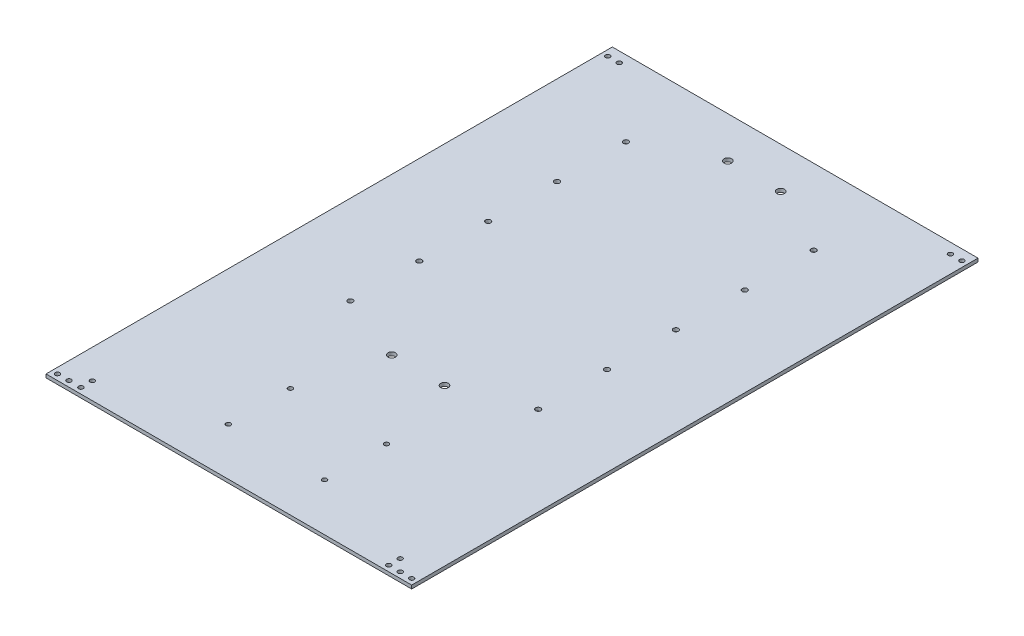
ISO-10303-21;
HEADER;
FILE_DESCRIPTION(('STEP AP214'),'2;1');
FILE_NAME('part.step','',(''),(''),'','','');
FILE_SCHEMA(('AUTOMOTIVE_DESIGN { 1 0 10303 214 1 1 1 1 }'));
ENDSEC;
DATA;
#1=APPLICATION_CONTEXT('core data for automotive mechanical design processes');
#2=APPLICATION_PROTOCOL_DEFINITION('international standard','automotive_design',2000,#1);
#3=PRODUCT_CONTEXT('',#1,'mechanical');
#4=PRODUCT('Part','Part','',(#3));
#5=PRODUCT_RELATED_PRODUCT_CATEGORY('part','',(#4));
#6=PRODUCT_DEFINITION_FORMATION('','',#4);
#7=PRODUCT_DEFINITION_CONTEXT('part definition',#1,'design');
#8=PRODUCT_DEFINITION('design','',#6,#7);
#9=PRODUCT_DEFINITION_SHAPE('','',#8);
#10=(LENGTH_UNIT() NAMED_UNIT(*) SI_UNIT(.MILLI.,.METRE.));
#11=(NAMED_UNIT(*) PLANE_ANGLE_UNIT() SI_UNIT($,.RADIAN.));
#12=(NAMED_UNIT(*) SI_UNIT($,.STERADIAN.) SOLID_ANGLE_UNIT());
#13=UNCERTAINTY_MEASURE_WITH_UNIT(LENGTH_MEASURE(1.E-05),#10,'distance_accuracy_value','');
#14=(GEOMETRIC_REPRESENTATION_CONTEXT(3) GLOBAL_UNCERTAINTY_ASSIGNED_CONTEXT((#13)) GLOBAL_UNIT_ASSIGNED_CONTEXT((#10,
#11,#12)) REPRESENTATION_CONTEXT('',''));
#15=CARTESIAN_POINT('',(0.,0.,0.));
#16=DIRECTION('',(0.,0.,1.));
#17=DIRECTION('',(1.,0.,0.));
#18=AXIS2_PLACEMENT_3D('',#15,#16,#17);
#19=CARTESIAN_POINT('',(0.,3.,0.));
#20=DIRECTION('',(0.,1.,0.));
#21=DIRECTION('',(0.,0.,1.));
#22=AXIS2_PLACEMENT_3D('',#19,#20,#21);
#23=PLANE('',#22);
#24=CARTESIAN_POINT('',(-22.9999999999972,3.,-211.012789491109));
#25=DIRECTION('',(0.,-1.,0.));
#26=DIRECTION('',(0.,0.,-1.));
#27=AXIS2_PLACEMENT_3D('',#24,#25,#26);
#28=CIRCLE('',#27,3.3);
#29=CARTESIAN_POINT('',(-22.9999999999972,3.,-214.312789491109));
#30=VERTEX_POINT('',#29);
#31=EDGE_CURVE('E806',#30,#30,#28,.T.);
#32=ORIENTED_EDGE('',*,*,#31,.T.);
#33=EDGE_LOOP('',(#32));
#34=FACE_BOUND('',#33,.T.);
#35=CARTESIAN_POINT('',(-41.9000000000008,3.,205.217949372989));
#36=DIRECTION('',(0.,-1.,0.));
#37=DIRECTION('',(0.,0.,-1.));
#38=AXIS2_PLACEMENT_3D('',#35,#36,#37);
#39=CIRCLE('',#38,2.00000000000002);
#40=CARTESIAN_POINT('',(-41.9000000000008,3.,203.217949372989));
#41=VERTEX_POINT('',#40);
#42=EDGE_CURVE('E807',#41,#41,#39,.T.);
#43=ORIENTED_EDGE('',*,*,#42,.T.);
#44=EDGE_LOOP('',(#43));
#45=FACE_BOUND('',#44,.T.);
#46=CARTESIAN_POINT('',(41.8999999999996,3.,151.21794937299));
#47=DIRECTION('',(0.,-1.,0.));
#48=DIRECTION('',(0.,0.,-1.));
#49=AXIS2_PLACEMENT_3D('',#46,#47,#48);
#50=CIRCLE('',#49,1.99999999999999);
#51=CARTESIAN_POINT('',(41.8999999999996,3.,149.21794937299));
#52=VERTEX_POINT('',#51);
#53=EDGE_CURVE('E811',#52,#52,#50,.T.);
#54=ORIENTED_EDGE('',*,*,#53,.T.);
#55=EDGE_LOOP('',(#54));
#56=FACE_BOUND('',#55,.T.);
#57=CARTESIAN_POINT('',(-41.9000000000003,3.,151.217949372989));
#58=DIRECTION('',(0.,-1.,0.));
#59=DIRECTION('',(0.,0.,-1.));
#60=AXIS2_PLACEMENT_3D('',#57,#58,#59);
#61=CIRCLE('',#60,2.00000000000004);
#62=CARTESIAN_POINT('',(-41.9000000000003,3.,149.217949372989));
#63=VERTEX_POINT('',#62);
#64=EDGE_CURVE('E818',#63,#63,#61,.T.);
#65=ORIENTED_EDGE('',*,*,#64,.T.);
#66=EDGE_LOOP('',(#65));
#67=FACE_BOUND('',#66,.T.);
#68=CARTESIAN_POINT('',(23.0000000000002,3.,81.7760919354657));
#69=DIRECTION('',(0.,-1.,0.));
#70=DIRECTION('',(0.,0.,-1.));
#71=AXIS2_PLACEMENT_3D('',#68,#69,#70);
#72=CIRCLE('',#71,3.3);
#73=CARTESIAN_POINT('',(23.0000000000002,3.,78.4760919354657));
#74=VERTEX_POINT('',#73);
#75=EDGE_CURVE('E851',#74,#74,#72,.T.);
#76=ORIENTED_EDGE('',*,*,#75,.T.);
#77=EDGE_LOOP('',(#76));
#78=FACE_BOUND('',#77,.T.);
#79=CARTESIAN_POINT('',(-22.9999999999997,3.,81.7760919354653));
#80=DIRECTION('',(0.,-1.,0.));
#81=DIRECTION('',(0.,0.,-1.));
#82=AXIS2_PLACEMENT_3D('',#79,#80,#81);
#83=CIRCLE('',#82,3.3);
#84=CARTESIAN_POINT('',(-22.9999999999997,3.,78.4760919354653));
#85=VERTEX_POINT('',#84);
#86=EDGE_CURVE('E814',#85,#85,#83,.T.);
#87=ORIENTED_EDGE('',*,*,#86,.T.);
#88=EDGE_LOOP('',(#87));
#89=FACE_BOUND('',#88,.T.);
#90=CARTESIAN_POINT('',(23.0000000000029,3.,-211.012789491108));
#91=DIRECTION('',(0.,-1.,0.));
#92=DIRECTION('',(0.,0.,-1.));
#93=AXIS2_PLACEMENT_3D('',#90,#91,#92);
#94=CIRCLE('',#93,3.3);
#95=CARTESIAN_POINT('',(23.0000000000029,3.,-214.312789491108));
#96=VERTEX_POINT('',#95);
#97=EDGE_CURVE('E808',#96,#96,#94,.T.);
#98=ORIENTED_EDGE('',*,*,#97,.T.);
#99=EDGE_LOOP('',(#98));
#100=FACE_BOUND('',#99,.T.);
#101=CARTESIAN_POINT('',(41.8999999999991,3.,205.21794937299));
#102=DIRECTION('',(0.,-1.,0.));
#103=DIRECTION('',(0.,0.,-1.));
#104=AXIS2_PLACEMENT_3D('',#101,#102,#103);
#105=CIRCLE('',#104,2.);
#106=CARTESIAN_POINT('',(41.8999999999991,3.,203.21794937299));
#107=VERTEX_POINT('',#106);
#108=EDGE_CURVE('E119',#107,#107,#105,.T.);
#109=ORIENTED_EDGE('',*,*,#108,.T.);
#110=EDGE_LOOP('',(#109));
#111=FACE_BOUND('',#110,.T.);
#112=CARTESIAN_POINT('',(-144.28,3.,241.665));
#113=DIRECTION('',(0.,1.,0.));
#114=DIRECTION('',(0.,0.,1.));
#115=AXIS2_PLACEMENT_3D('',#112,#113,#114);
#116=CIRCLE('',#115,2.);
#117=CARTESIAN_POINT('',(-144.28,3.,243.665));
#118=VERTEX_POINT('',#117);
#119=EDGE_CURVE('E151',#118,#118,#116,.T.);
#120=ORIENTED_EDGE('',*,*,#119,.F.);
#121=EDGE_LOOP('',(#120));
#122=FACE_BOUND('',#121,.T.);
#123=CARTESIAN_POINT('',(-133.885842783126,3.,231.665));
#124=DIRECTION('',(0.,1.,0.));
#125=DIRECTION('',(0.,0.,1.));
#126=AXIS2_PLACEMENT_3D('',#123,#124,#125);
#127=CIRCLE('',#126,2.);
#128=CARTESIAN_POINT('',(-133.885842783126,3.,233.665));
#129=VERTEX_POINT('',#128);
#130=EDGE_CURVE('E163',#129,#129,#127,.T.);
#131=ORIENTED_EDGE('',*,*,#130,.F.);
#132=EDGE_LOOP('',(#131));
#133=FACE_BOUND('',#132,.T.);
#134=CARTESIAN_POINT('',(144.28,3.,241.665));
#135=DIRECTION('',(0.,1.,0.));
#136=DIRECTION('',(0.,0.,1.));
#137=AXIS2_PLACEMENT_3D('',#134,#135,#136);
#138=CIRCLE('',#137,2.);
#139=CARTESIAN_POINT('',(144.28,3.,243.665));
#140=VERTEX_POINT('',#139);
#141=EDGE_CURVE('E175',#140,#140,#138,.T.);
#142=ORIENTED_EDGE('',*,*,#141,.F.);
#143=EDGE_LOOP('',(#142));
#144=FACE_BOUND('',#143,.T.);
#145=CARTESIAN_POINT('',(134.28,3.,231.665));
#146=DIRECTION('',(0.,1.,0.));
#147=DIRECTION('',(0.,0.,1.));
#148=AXIS2_PLACEMENT_3D('',#145,#146,#147);
#149=CIRCLE('',#148,2.);
#150=CARTESIAN_POINT('',(134.28,3.,233.665));
#151=VERTEX_POINT('',#150);
#152=EDGE_CURVE('E187',#151,#151,#149,.T.);
#153=ORIENTED_EDGE('',*,*,#152,.F.);
#154=EDGE_LOOP('',(#153));
#155=FACE_BOUND('',#154,.T.);
#156=CARTESIAN_POINT('',(144.28,3.,-237.665));
#157=DIRECTION('',(0.,1.,0.));
#158=DIRECTION('',(0.,0.,1.));
#159=AXIS2_PLACEMENT_3D('',#156,#157,#158);
#160=CIRCLE('',#159,2.);
#161=CARTESIAN_POINT('',(144.28,3.,-235.665));
#162=VERTEX_POINT('',#161);
#163=EDGE_CURVE('E199',#162,#162,#160,.T.);
#164=ORIENTED_EDGE('',*,*,#163,.F.);
#165=EDGE_LOOP('',(#164));
#166=FACE_BOUND('',#165,.T.);
#167=CARTESIAN_POINT('',(-154.280000000007,3.,-237.665));
#168=DIRECTION('',(0.,1.,0.));
#169=DIRECTION('',(0.,0.,1.));
#170=AXIS2_PLACEMENT_3D('',#167,#168,#169);
#171=CIRCLE('',#170,2.);
#172=CARTESIAN_POINT('',(-154.280000000007,3.,-235.665));
#173=VERTEX_POINT('',#172);
#174=EDGE_CURVE('E211',#173,#173,#171,.T.);
#175=ORIENTED_EDGE('',*,*,#174,.F.);
#176=EDGE_LOOP('',(#175));
#177=FACE_BOUND('',#176,.T.);
#178=CARTESIAN_POINT('',(-81.7800000000064,3.,-121.012789491108));
#179=DIRECTION('',(0.,1.,0.));
#180=DIRECTION('',(0.,0.,1.));
#181=AXIS2_PLACEMENT_3D('',#178,#179,#180);
#182=CIRCLE('',#181,2.25);
#183=CARTESIAN_POINT('',(-81.7800000000064,3.,-118.762789491108));
#184=VERTEX_POINT('',#183);
#185=EDGE_CURVE('E223',#184,#184,#182,.T.);
#186=ORIENTED_EDGE('',*,*,#185,.F.);
#187=EDGE_LOOP('',(#186));
#188=FACE_BOUND('',#187,.T.);
#189=CARTESIAN_POINT('',(-81.7800000000065,3.,-1.01278949110847));
#190=DIRECTION('',(0.,1.,0.));
#191=DIRECTION('',(0.,0.,1.));
#192=AXIS2_PLACEMENT_3D('',#189,#190,#191);
#193=CIRCLE('',#192,2.25);
#194=CARTESIAN_POINT('',(-81.7800000000065,3.,1.23721050889152));
#195=VERTEX_POINT('',#194);
#196=EDGE_CURVE('E235',#195,#195,#193,.T.);
#197=ORIENTED_EDGE('',*,*,#196,.F.);
#198=EDGE_LOOP('',(#197));
#199=FACE_BOUND('',#198,.T.);
#200=CARTESIAN_POINT('',(81.78,3.,-1.01278949110836));
#201=DIRECTION('',(0.,1.,0.));
#202=DIRECTION('',(0.,0.,1.));
#203=AXIS2_PLACEMENT_3D('',#200,#201,#202);
#204=CIRCLE('',#203,2.25);
#205=CARTESIAN_POINT('',(81.78,3.,1.23721050889163));
#206=VERTEX_POINT('',#205);
#207=EDGE_CURVE('E247',#206,#206,#204,.T.);
#208=ORIENTED_EDGE('',*,*,#207,.F.);
#209=EDGE_LOOP('',(#208));
#210=FACE_BOUND('',#209,.T.);
#211=CARTESIAN_POINT('',(81.78,3.,-61.0127894911084));
#212=DIRECTION('',(0.,1.,0.));
#213=DIRECTION('',(0.,0.,1.));
#214=AXIS2_PLACEMENT_3D('',#211,#212,#213);
#215=CIRCLE('',#214,2.25);
#216=CARTESIAN_POINT('',(81.78,3.,-58.7627894911084));
#217=VERTEX_POINT('',#216);
#218=EDGE_CURVE('E259',#217,#217,#215,.T.);
#219=ORIENTED_EDGE('',*,*,#218,.F.);
#220=EDGE_LOOP('',(#219));
#221=FACE_BOUND('',#220,.T.);
#222=CARTESIAN_POINT('',(81.78,3.,-181.012789491108));
#223=DIRECTION('',(0.,1.,0.));
#224=DIRECTION('',(0.,0.,1.));
#225=AXIS2_PLACEMENT_3D('',#222,#223,#224);
#226=CIRCLE('',#225,2.25);
#227=CARTESIAN_POINT('',(81.78,3.,-178.762789491108));
#228=VERTEX_POINT('',#227);
#229=EDGE_CURVE('E109',#228,#228,#226,.T.);
#230=ORIENTED_EDGE('',*,*,#229,.F.);
#231=EDGE_LOOP('',(#230));
#232=FACE_BOUND('',#231,.T.);
#233=DIRECTION('',(0.,0.,-1.));
#234=VECTOR('',#233,1.);
#235=CARTESIAN_POINT('',(159.28,3.,-246.665));
#236=LINE('',#235,#234);
#237=CARTESIAN_POINT('',(159.28,3.,246.665));
#238=VERTEX_POINT('',#237);
#239=CARTESIAN_POINT('',(159.28,3.,-246.665));
#240=VERTEX_POINT('',#239);
#241=EDGE_CURVE('E93',#238,#240,#236,.T.);
#242=ORIENTED_EDGE('',*,*,#241,.T.);
#243=DIRECTION('',(-1.,0.,0.));
#244=VECTOR('',#243,1.);
#245=CARTESIAN_POINT('',(-159.28,3.,-246.665));
#246=LINE('',#245,#244);
#247=CARTESIAN_POINT('',(-159.28,3.,-246.665));
#248=VERTEX_POINT('',#247);
#249=EDGE_CURVE('E88',#240,#248,#246,.T.);
#250=ORIENTED_EDGE('',*,*,#249,.T.);
#251=DIRECTION('',(0.,0.,1.));
#252=VECTOR('',#251,1.);
#253=CARTESIAN_POINT('',(-159.28,3.,-246.665));
#254=LINE('',#253,#252);
#255=CARTESIAN_POINT('',(-159.28,3.,246.665));
#256=VERTEX_POINT('',#255);
#257=EDGE_CURVE('E91',#248,#256,#254,.T.);
#258=ORIENTED_EDGE('',*,*,#257,.T.);
#259=DIRECTION('',(1.,0.,0.));
#260=VECTOR('',#259,1.);
#261=CARTESIAN_POINT('',(-159.28,3.,246.665));
#262=LINE('',#261,#260);
#263=EDGE_CURVE('E58',#256,#238,#262,.T.);
#264=ORIENTED_EDGE('',*,*,#263,.T.);
#265=EDGE_LOOP('',(#242,#250,#258,#264));
#266=FACE_BOUND('',#265,.T.);
#267=CARTESIAN_POINT('',(81.78,3.,-121.012789491108));
#268=DIRECTION('',(0.,1.,0.));
#269=DIRECTION('',(0.,0.,1.));
#270=AXIS2_PLACEMENT_3D('',#267,#268,#269);
#271=CIRCLE('',#270,2.25);
#272=CARTESIAN_POINT('',(81.78,3.,-118.762789491108));
#273=VERTEX_POINT('',#272);
#274=EDGE_CURVE('E265',#273,#273,#271,.T.);
#275=ORIENTED_EDGE('',*,*,#274,.F.);
#276=EDGE_LOOP('',(#275));
#277=FACE_BOUND('',#276,.T.);
#278=CARTESIAN_POINT('',(81.7799999999999,3.,58.9872105088916));
#279=DIRECTION('',(0.,1.,0.));
#280=DIRECTION('',(0.,0.,1.));
#281=AXIS2_PLACEMENT_3D('',#278,#279,#280);
#282=CIRCLE('',#281,2.24999999999999);
#283=CARTESIAN_POINT('',(81.7799999999999,3.,61.2372105088916));
#284=VERTEX_POINT('',#283);
#285=EDGE_CURVE('E253',#284,#284,#282,.T.);
#286=ORIENTED_EDGE('',*,*,#285,.F.);
#287=EDGE_LOOP('',(#286));
#288=FACE_BOUND('',#287,.T.);
#289=CARTESIAN_POINT('',(-81.7800000000065,3.,58.9872105088915));
#290=DIRECTION('',(0.,1.,0.));
#291=DIRECTION('',(0.,0.,1.));
#292=AXIS2_PLACEMENT_3D('',#289,#290,#291);
#293=CIRCLE('',#292,2.25);
#294=CARTESIAN_POINT('',(-81.7800000000065,3.,61.2372105088915));
#295=VERTEX_POINT('',#294);
#296=EDGE_CURVE('E241',#295,#295,#293,.T.);
#297=ORIENTED_EDGE('',*,*,#296,.F.);
#298=EDGE_LOOP('',(#297));
#299=FACE_BOUND('',#298,.T.);
#300=CARTESIAN_POINT('',(-81.7800000000065,3.,-61.0127894911085));
#301=DIRECTION('',(0.,1.,0.));
#302=DIRECTION('',(0.,0.,1.));
#303=AXIS2_PLACEMENT_3D('',#300,#301,#302);
#304=CIRCLE('',#303,2.25);
#305=CARTESIAN_POINT('',(-81.7800000000065,3.,-58.7627894911085));
#306=VERTEX_POINT('',#305);
#307=EDGE_CURVE('E229',#306,#306,#304,.T.);
#308=ORIENTED_EDGE('',*,*,#307,.F.);
#309=EDGE_LOOP('',(#308));
#310=FACE_BOUND('',#309,.T.);
#311=CARTESIAN_POINT('',(-81.7800000000064,3.,-181.012789491108));
#312=DIRECTION('',(0.,1.,0.));
#313=DIRECTION('',(0.,0.,1.));
#314=AXIS2_PLACEMENT_3D('',#311,#312,#313);
#315=CIRCLE('',#314,2.25);
#316=CARTESIAN_POINT('',(-81.7800000000064,3.,-178.762789491108));
#317=VERTEX_POINT('',#316);
#318=EDGE_CURVE('E217',#317,#317,#315,.T.);
#319=ORIENTED_EDGE('',*,*,#318,.F.);
#320=EDGE_LOOP('',(#319));
#321=FACE_BOUND('',#320,.T.);
#322=CARTESIAN_POINT('',(-144.28,3.,-237.665));
#323=DIRECTION('',(0.,1.,0.));
#324=DIRECTION('',(0.,0.,1.));
#325=AXIS2_PLACEMENT_3D('',#322,#323,#324);
#326=CIRCLE('',#325,2.);
#327=CARTESIAN_POINT('',(-144.28,3.,-235.665));
#328=VERTEX_POINT('',#327);
#329=EDGE_CURVE('E205',#328,#328,#326,.T.);
#330=ORIENTED_EDGE('',*,*,#329,.F.);
#331=EDGE_LOOP('',(#330));
#332=FACE_BOUND('',#331,.T.);
#333=CARTESIAN_POINT('',(154.28,3.,-237.665));
#334=DIRECTION('',(0.,1.,0.));
#335=DIRECTION('',(0.,0.,1.));
#336=AXIS2_PLACEMENT_3D('',#333,#334,#335);
#337=CIRCLE('',#336,2.);
#338=CARTESIAN_POINT('',(154.28,3.,-235.665));
#339=VERTEX_POINT('',#338);
#340=EDGE_CURVE('E193',#339,#339,#337,.T.);
#341=ORIENTED_EDGE('',*,*,#340,.F.);
#342=EDGE_LOOP('',(#341));
#343=FACE_BOUND('',#342,.T.);
#344=CARTESIAN_POINT('',(134.28,3.,241.665));
#345=DIRECTION('',(0.,1.,0.));
#346=DIRECTION('',(0.,0.,1.));
#347=AXIS2_PLACEMENT_3D('',#344,#345,#346);
#348=CIRCLE('',#347,2.);
#349=CARTESIAN_POINT('',(134.28,3.,243.665));
#350=VERTEX_POINT('',#349);
#351=EDGE_CURVE('E181',#350,#350,#348,.T.);
#352=ORIENTED_EDGE('',*,*,#351,.F.);
#353=EDGE_LOOP('',(#352));
#354=FACE_BOUND('',#353,.T.);
#355=CARTESIAN_POINT('',(154.28,3.,241.665));
#356=DIRECTION('',(0.,1.,0.));
#357=DIRECTION('',(0.,0.,1.));
#358=AXIS2_PLACEMENT_3D('',#355,#356,#357);
#359=CIRCLE('',#358,2.);
#360=CARTESIAN_POINT('',(154.28,3.,243.665));
#361=VERTEX_POINT('',#360);
#362=EDGE_CURVE('E169',#361,#361,#359,.T.);
#363=ORIENTED_EDGE('',*,*,#362,.F.);
#364=EDGE_LOOP('',(#363));
#365=FACE_BOUND('',#364,.T.);
#366=CARTESIAN_POINT('',(-133.885842783126,3.,241.665));
#367=DIRECTION('',(0.,1.,0.));
#368=DIRECTION('',(0.,0.,1.));
#369=AXIS2_PLACEMENT_3D('',#366,#367,#368);
#370=CIRCLE('',#369,2.);
#371=CARTESIAN_POINT('',(-133.885842783126,3.,243.665));
#372=VERTEX_POINT('',#371);
#373=EDGE_CURVE('E157',#372,#372,#370,.T.);
#374=ORIENTED_EDGE('',*,*,#373,.F.);
#375=EDGE_LOOP('',(#374));
#376=FACE_BOUND('',#375,.T.);
#377=CARTESIAN_POINT('',(-154.280000000003,3.,241.665000000002));
#378=DIRECTION('',(0.,1.,0.));
#379=DIRECTION('',(0.,0.,1.));
#380=AXIS2_PLACEMENT_3D('',#377,#378,#379);
#381=CIRCLE('',#380,1.99999999999731);
#382=CARTESIAN_POINT('',(-154.280000000003,3.,243.664999999999));
#383=VERTEX_POINT('',#382);
#384=EDGE_CURVE('E142',#383,#383,#381,.T.);
#385=ORIENTED_EDGE('',*,*,#384,.F.);
#386=EDGE_LOOP('',(#385));
#387=FACE_BOUND('',#386,.T.);
#388=ADVANCED_FACE('F39',(#34,#45,#56,#67,#78,#89,#100,#111,#122,#133,#144,#155,#166,#177,#188,
#199,#210,#221,#232,#266,#277,#288,#299,#310,#321,#332,#343,#354,#365,#376,#387),#23,.T.);
#389=CARTESIAN_POINT('',(0.,0.,0.));
#390=DIRECTION('',(0.,1.,0.));
#391=DIRECTION('',(0.,0.,1.));
#392=AXIS2_PLACEMENT_3D('',#389,#390,#391);
#393=PLANE('',#392);
#394=CARTESIAN_POINT('',(-22.9999999999972,0.,-211.012789491109));
#395=DIRECTION('',(0.,1.,0.));
#396=DIRECTION('',(0.,0.,1.));
#397=AXIS2_PLACEMENT_3D('',#394,#395,#396);
#398=CIRCLE('',#397,3.3);
#399=CARTESIAN_POINT('',(-22.9999999999972,0.,-207.712789491109));
#400=VERTEX_POINT('',#399);
#401=EDGE_CURVE('E43',#400,#400,#398,.T.);
#402=ORIENTED_EDGE('',*,*,#401,.T.);
#403=EDGE_LOOP('',(#402));
#404=FACE_BOUND('',#403,.T.);
#405=CARTESIAN_POINT('',(-41.9000000000008,0.,205.217949372989));
#406=DIRECTION('',(0.,1.,0.));
#407=DIRECTION('',(0.,0.,1.));
#408=AXIS2_PLACEMENT_3D('',#405,#406,#407);
#409=CIRCLE('',#408,2.00000000000002);
#410=CARTESIAN_POINT('',(-41.9000000000008,0.,207.217949372989));
#411=VERTEX_POINT('',#410);
#412=EDGE_CURVE('E133',#411,#411,#409,.T.);
#413=ORIENTED_EDGE('',*,*,#412,.T.);
#414=EDGE_LOOP('',(#413));
#415=FACE_BOUND('',#414,.T.);
#416=CARTESIAN_POINT('',(41.8999999999996,0.,151.21794937299));
#417=DIRECTION('',(0.,1.,0.));
#418=DIRECTION('',(0.,0.,1.));
#419=AXIS2_PLACEMENT_3D('',#416,#417,#418);
#420=CIRCLE('',#419,1.99999999999999);
#421=CARTESIAN_POINT('',(41.8999999999996,0.,153.21794937299));
#422=VERTEX_POINT('',#421);
#423=EDGE_CURVE('E131',#422,#422,#420,.T.);
#424=ORIENTED_EDGE('',*,*,#423,.T.);
#425=EDGE_LOOP('',(#424));
#426=FACE_BOUND('',#425,.T.);
#427=CARTESIAN_POINT('',(-41.9000000000003,0.,151.217949372989));
#428=DIRECTION('',(0.,1.,0.));
#429=DIRECTION('',(0.,0.,1.));
#430=AXIS2_PLACEMENT_3D('',#427,#428,#429);
#431=CIRCLE('',#430,2.00000000000004);
#432=CARTESIAN_POINT('',(-41.9000000000003,0.,153.217949372989));
#433=VERTEX_POINT('',#432);
#434=EDGE_CURVE('E128',#433,#433,#431,.T.);
#435=ORIENTED_EDGE('',*,*,#434,.T.);
#436=EDGE_LOOP('',(#435));
#437=FACE_BOUND('',#436,.T.);
#438=CARTESIAN_POINT('',(23.0000000000002,0.,81.7760919354657));
#439=DIRECTION('',(0.,1.,0.));
#440=DIRECTION('',(0.,0.,1.));
#441=AXIS2_PLACEMENT_3D('',#438,#439,#440);
#442=CIRCLE('',#441,3.3);
#443=CARTESIAN_POINT('',(23.0000000000002,0.,85.0760919354657));
#444=VERTEX_POINT('',#443);
#445=EDGE_CURVE('E125',#444,#444,#442,.T.);
#446=ORIENTED_EDGE('',*,*,#445,.T.);
#447=EDGE_LOOP('',(#446));
#448=FACE_BOUND('',#447,.T.);
#449=CARTESIAN_POINT('',(-22.9999999999997,0.,81.7760919354653));
#450=DIRECTION('',(0.,1.,0.));
#451=DIRECTION('',(0.,0.,1.));
#452=AXIS2_PLACEMENT_3D('',#449,#450,#451);
#453=CIRCLE('',#452,3.3);
#454=CARTESIAN_POINT('',(-22.9999999999997,0.,85.0760919354653));
#455=VERTEX_POINT('',#454);
#456=EDGE_CURVE('E122',#455,#455,#453,.T.);
#457=ORIENTED_EDGE('',*,*,#456,.T.);
#458=EDGE_LOOP('',(#457));
#459=FACE_BOUND('',#458,.T.);
#460=CARTESIAN_POINT('',(23.0000000000029,0.,-211.012789491108));
#461=DIRECTION('',(0.,1.,0.));
#462=DIRECTION('',(0.,0.,1.));
#463=AXIS2_PLACEMENT_3D('',#460,#461,#462);
#464=CIRCLE('',#463,3.3);
#465=CARTESIAN_POINT('',(23.0000000000029,0.,-207.712789491108));
#466=VERTEX_POINT('',#465);
#467=EDGE_CURVE('E118',#466,#466,#464,.T.);
#468=ORIENTED_EDGE('',*,*,#467,.T.);
#469=EDGE_LOOP('',(#468));
#470=FACE_BOUND('',#469,.T.);
#471=CARTESIAN_POINT('',(41.8999999999991,0.,205.21794937299));
#472=DIRECTION('',(0.,1.,0.));
#473=DIRECTION('',(0.,0.,1.));
#474=AXIS2_PLACEMENT_3D('',#471,#472,#473);
#475=CIRCLE('',#474,2.);
#476=CARTESIAN_POINT('',(41.8999999999991,0.,207.21794937299));
#477=VERTEX_POINT('',#476);
#478=EDGE_CURVE('E115',#477,#477,#475,.T.);
#479=ORIENTED_EDGE('',*,*,#478,.T.);
#480=EDGE_LOOP('',(#479));
#481=FACE_BOUND('',#480,.T.);
#482=DIRECTION('',(0.,0.,-1.));
#483=VECTOR('',#482,1.);
#484=CARTESIAN_POINT('',(159.28,0.,-246.665));
#485=LINE('',#484,#483);
#486=CARTESIAN_POINT('',(159.28,0.,246.665));
#487=VERTEX_POINT('',#486);
#488=CARTESIAN_POINT('',(159.28,0.,-246.665));
#489=VERTEX_POINT('',#488);
#490=EDGE_CURVE('E106',#487,#489,#485,.T.);
#491=ORIENTED_EDGE('',*,*,#490,.F.);
#492=DIRECTION('',(1.,0.,0.));
#493=VECTOR('',#492,1.);
#494=CARTESIAN_POINT('',(-159.28,0.,246.665));
#495=LINE('',#494,#493);
#496=CARTESIAN_POINT('',(-159.28,0.,246.665));
#497=VERTEX_POINT('',#496);
#498=EDGE_CURVE('E81',#497,#487,#495,.T.);
#499=ORIENTED_EDGE('',*,*,#498,.F.);
#500=DIRECTION('',(0.,0.,1.));
#501=VECTOR('',#500,1.);
#502=CARTESIAN_POINT('',(-159.28,0.,-246.665));
#503=LINE('',#502,#501);
#504=CARTESIAN_POINT('',(-159.28,0.,-246.665));
#505=VERTEX_POINT('',#504);
#506=EDGE_CURVE('E75',#505,#497,#503,.T.);
#507=ORIENTED_EDGE('',*,*,#506,.F.);
#508=DIRECTION('',(-1.,0.,0.));
#509=VECTOR('',#508,1.);
#510=CARTESIAN_POINT('',(-159.28,0.,-246.665));
#511=LINE('',#510,#509);
#512=EDGE_CURVE('E97',#489,#505,#511,.T.);
#513=ORIENTED_EDGE('',*,*,#512,.F.);
#514=EDGE_LOOP('',(#491,#499,#507,#513));
#515=FACE_BOUND('',#514,.T.);
#516=CARTESIAN_POINT('',(81.78,0.,-181.012789491108));
#517=DIRECTION('',(0.,1.,0.));
#518=DIRECTION('',(0.,0.,1.));
#519=AXIS2_PLACEMENT_3D('',#516,#517,#518);
#520=CIRCLE('',#519,2.25);
#521=CARTESIAN_POINT('',(81.78,0.,-178.762789491108));
#522=VERTEX_POINT('',#521);
#523=EDGE_CURVE('E268',#522,#522,#520,.T.);
#524=ORIENTED_EDGE('',*,*,#523,.T.);
#525=EDGE_LOOP('',(#524));
#526=FACE_BOUND('',#525,.T.);
#527=CARTESIAN_POINT('',(81.78,0.,-121.012789491108));
#528=DIRECTION('',(0.,1.,0.));
#529=DIRECTION('',(0.,0.,1.));
#530=AXIS2_PLACEMENT_3D('',#527,#528,#529);
#531=CIRCLE('',#530,2.25);
#532=CARTESIAN_POINT('',(81.78,0.,-118.762789491108));
#533=VERTEX_POINT('',#532);
#534=EDGE_CURVE('E262',#533,#533,#531,.T.);
#535=ORIENTED_EDGE('',*,*,#534,.T.);
#536=EDGE_LOOP('',(#535));
#537=FACE_BOUND('',#536,.T.);
#538=CARTESIAN_POINT('',(81.78,0.,-61.0127894911084));
#539=DIRECTION('',(0.,1.,0.));
#540=DIRECTION('',(0.,0.,1.));
#541=AXIS2_PLACEMENT_3D('',#538,#539,#540);
#542=CIRCLE('',#541,2.25);
#543=CARTESIAN_POINT('',(81.78,0.,-58.7627894911084));
#544=VERTEX_POINT('',#543);
#545=EDGE_CURVE('E256',#544,#544,#542,.T.);
#546=ORIENTED_EDGE('',*,*,#545,.T.);
#547=EDGE_LOOP('',(#546));
#548=FACE_BOUND('',#547,.T.);
#549=CARTESIAN_POINT('',(81.7799999999999,0.,58.9872105088916));
#550=DIRECTION('',(0.,1.,0.));
#551=DIRECTION('',(0.,0.,1.));
#552=AXIS2_PLACEMENT_3D('',#549,#550,#551);
#553=CIRCLE('',#552,2.24999999999999);
#554=CARTESIAN_POINT('',(81.7799999999999,0.,61.2372105088916));
#555=VERTEX_POINT('',#554);
#556=EDGE_CURVE('E250',#555,#555,#553,.T.);
#557=ORIENTED_EDGE('',*,*,#556,.T.);
#558=EDGE_LOOP('',(#557));
#559=FACE_BOUND('',#558,.T.);
#560=CARTESIAN_POINT('',(81.78,0.,-1.01278949110836));
#561=DIRECTION('',(0.,1.,0.));
#562=DIRECTION('',(0.,0.,1.));
#563=AXIS2_PLACEMENT_3D('',#560,#561,#562);
#564=CIRCLE('',#563,2.25);
#565=CARTESIAN_POINT('',(81.78,0.,1.23721050889163));
#566=VERTEX_POINT('',#565);
#567=EDGE_CURVE('E244',#566,#566,#564,.T.);
#568=ORIENTED_EDGE('',*,*,#567,.T.);
#569=EDGE_LOOP('',(#568));
#570=FACE_BOUND('',#569,.T.);
#571=CARTESIAN_POINT('',(-81.7800000000065,0.,58.9872105088915));
#572=DIRECTION('',(0.,1.,0.));
#573=DIRECTION('',(0.,0.,1.));
#574=AXIS2_PLACEMENT_3D('',#571,#572,#573);
#575=CIRCLE('',#574,2.25);
#576=CARTESIAN_POINT('',(-81.7800000000065,0.,61.2372105088915));
#577=VERTEX_POINT('',#576);
#578=EDGE_CURVE('E238',#577,#577,#575,.T.);
#579=ORIENTED_EDGE('',*,*,#578,.T.);
#580=EDGE_LOOP('',(#579));
#581=FACE_BOUND('',#580,.T.);
#582=CARTESIAN_POINT('',(-81.7800000000065,0.,-1.01278949110847));
#583=DIRECTION('',(0.,1.,0.));
#584=DIRECTION('',(0.,0.,1.));
#585=AXIS2_PLACEMENT_3D('',#582,#583,#584);
#586=CIRCLE('',#585,2.25);
#587=CARTESIAN_POINT('',(-81.7800000000065,0.,1.23721050889152));
#588=VERTEX_POINT('',#587);
#589=EDGE_CURVE('E232',#588,#588,#586,.T.);
#590=ORIENTED_EDGE('',*,*,#589,.T.);
#591=EDGE_LOOP('',(#590));
#592=FACE_BOUND('',#591,.T.);
#593=CARTESIAN_POINT('',(-81.7800000000065,0.,-61.0127894911085));
#594=DIRECTION('',(0.,1.,0.));
#595=DIRECTION('',(0.,0.,1.));
#596=AXIS2_PLACEMENT_3D('',#593,#594,#595);
#597=CIRCLE('',#596,2.25);
#598=CARTESIAN_POINT('',(-81.7800000000065,0.,-58.7627894911085));
#599=VERTEX_POINT('',#598);
#600=EDGE_CURVE('E226',#599,#599,#597,.T.);
#601=ORIENTED_EDGE('',*,*,#600,.T.);
#602=EDGE_LOOP('',(#601));
#603=FACE_BOUND('',#602,.T.);
#604=CARTESIAN_POINT('',(-81.7800000000064,0.,-121.012789491108));
#605=DIRECTION('',(0.,1.,0.));
#606=DIRECTION('',(0.,0.,1.));
#607=AXIS2_PLACEMENT_3D('',#604,#605,#606);
#608=CIRCLE('',#607,2.25);
#609=CARTESIAN_POINT('',(-81.7800000000064,0.,-118.762789491108));
#610=VERTEX_POINT('',#609);
#611=EDGE_CURVE('E220',#610,#610,#608,.T.);
#612=ORIENTED_EDGE('',*,*,#611,.T.);
#613=EDGE_LOOP('',(#612));
#614=FACE_BOUND('',#613,.T.);
#615=CARTESIAN_POINT('',(-81.7800000000064,0.,-181.012789491108));
#616=DIRECTION('',(0.,1.,0.));
#617=DIRECTION('',(0.,0.,1.));
#618=AXIS2_PLACEMENT_3D('',#615,#616,#617);
#619=CIRCLE('',#618,2.25);
#620=CARTESIAN_POINT('',(-81.7800000000064,0.,-178.762789491108));
#621=VERTEX_POINT('',#620);
#622=EDGE_CURVE('E214',#621,#621,#619,.T.);
#623=ORIENTED_EDGE('',*,*,#622,.T.);
#624=EDGE_LOOP('',(#623));
#625=FACE_BOUND('',#624,.T.);
#626=CARTESIAN_POINT('',(-154.280000000007,0.,-237.665));
#627=DIRECTION('',(0.,1.,0.));
#628=DIRECTION('',(0.,0.,1.));
#629=AXIS2_PLACEMENT_3D('',#626,#627,#628);
#630=CIRCLE('',#629,2.);
#631=CARTESIAN_POINT('',(-154.280000000007,0.,-235.665));
#632=VERTEX_POINT('',#631);
#633=EDGE_CURVE('E208',#632,#632,#630,.T.);
#634=ORIENTED_EDGE('',*,*,#633,.T.);
#635=EDGE_LOOP('',(#634));
#636=FACE_BOUND('',#635,.T.);
#637=CARTESIAN_POINT('',(-144.28,0.,-237.665));
#638=DIRECTION('',(0.,1.,0.));
#639=DIRECTION('',(0.,0.,1.));
#640=AXIS2_PLACEMENT_3D('',#637,#638,#639);
#641=CIRCLE('',#640,2.);
#642=CARTESIAN_POINT('',(-144.28,0.,-235.665));
#643=VERTEX_POINT('',#642);
#644=EDGE_CURVE('E202',#643,#643,#641,.T.);
#645=ORIENTED_EDGE('',*,*,#644,.T.);
#646=EDGE_LOOP('',(#645));
#647=FACE_BOUND('',#646,.T.);
#648=CARTESIAN_POINT('',(144.28,0.,-237.665));
#649=DIRECTION('',(0.,1.,0.));
#650=DIRECTION('',(0.,0.,1.));
#651=AXIS2_PLACEMENT_3D('',#648,#649,#650);
#652=CIRCLE('',#651,2.);
#653=CARTESIAN_POINT('',(144.28,0.,-235.665));
#654=VERTEX_POINT('',#653);
#655=EDGE_CURVE('E196',#654,#654,#652,.T.);
#656=ORIENTED_EDGE('',*,*,#655,.T.);
#657=EDGE_LOOP('',(#656));
#658=FACE_BOUND('',#657,.T.);
#659=CARTESIAN_POINT('',(154.28,0.,-237.665));
#660=DIRECTION('',(0.,1.,0.));
#661=DIRECTION('',(0.,0.,1.));
#662=AXIS2_PLACEMENT_3D('',#659,#660,#661);
#663=CIRCLE('',#662,2.);
#664=CARTESIAN_POINT('',(154.28,0.,-235.665));
#665=VERTEX_POINT('',#664);
#666=EDGE_CURVE('E190',#665,#665,#663,.T.);
#667=ORIENTED_EDGE('',*,*,#666,.T.);
#668=EDGE_LOOP('',(#667));
#669=FACE_BOUND('',#668,.T.);
#670=CARTESIAN_POINT('',(134.28,0.,231.665));
#671=DIRECTION('',(0.,1.,0.));
#672=DIRECTION('',(0.,0.,1.));
#673=AXIS2_PLACEMENT_3D('',#670,#671,#672);
#674=CIRCLE('',#673,2.);
#675=CARTESIAN_POINT('',(134.28,0.,233.665));
#676=VERTEX_POINT('',#675);
#677=EDGE_CURVE('E184',#676,#676,#674,.T.);
#678=ORIENTED_EDGE('',*,*,#677,.T.);
#679=EDGE_LOOP('',(#678));
#680=FACE_BOUND('',#679,.T.);
#681=CARTESIAN_POINT('',(134.28,0.,241.665));
#682=DIRECTION('',(0.,1.,0.));
#683=DIRECTION('',(0.,0.,1.));
#684=AXIS2_PLACEMENT_3D('',#681,#682,#683);
#685=CIRCLE('',#684,2.);
#686=CARTESIAN_POINT('',(134.28,0.,243.665));
#687=VERTEX_POINT('',#686);
#688=EDGE_CURVE('E178',#687,#687,#685,.T.);
#689=ORIENTED_EDGE('',*,*,#688,.T.);
#690=EDGE_LOOP('',(#689));
#691=FACE_BOUND('',#690,.T.);
#692=CARTESIAN_POINT('',(144.28,0.,241.665));
#693=DIRECTION('',(0.,1.,0.));
#694=DIRECTION('',(0.,0.,1.));
#695=AXIS2_PLACEMENT_3D('',#692,#693,#694);
#696=CIRCLE('',#695,2.);
#697=CARTESIAN_POINT('',(144.28,0.,243.665));
#698=VERTEX_POINT('',#697);
#699=EDGE_CURVE('E172',#698,#698,#696,.T.);
#700=ORIENTED_EDGE('',*,*,#699,.T.);
#701=EDGE_LOOP('',(#700));
#702=FACE_BOUND('',#701,.T.);
#703=CARTESIAN_POINT('',(154.28,0.,241.665));
#704=DIRECTION('',(0.,1.,0.));
#705=DIRECTION('',(0.,0.,1.));
#706=AXIS2_PLACEMENT_3D('',#703,#704,#705);
#707=CIRCLE('',#706,2.);
#708=CARTESIAN_POINT('',(154.28,0.,243.665));
#709=VERTEX_POINT('',#708);
#710=EDGE_CURVE('E166',#709,#709,#707,.T.);
#711=ORIENTED_EDGE('',*,*,#710,.T.);
#712=EDGE_LOOP('',(#711));
#713=FACE_BOUND('',#712,.T.);
#714=CARTESIAN_POINT('',(-133.885842783126,0.,231.665));
#715=DIRECTION('',(0.,1.,0.));
#716=DIRECTION('',(0.,0.,1.));
#717=AXIS2_PLACEMENT_3D('',#714,#715,#716);
#718=CIRCLE('',#717,2.);
#719=CARTESIAN_POINT('',(-133.885842783126,0.,233.665));
#720=VERTEX_POINT('',#719);
#721=EDGE_CURVE('E160',#720,#720,#718,.T.);
#722=ORIENTED_EDGE('',*,*,#721,.T.);
#723=EDGE_LOOP('',(#722));
#724=FACE_BOUND('',#723,.T.);
#725=CARTESIAN_POINT('',(-133.885842783126,0.,241.665));
#726=DIRECTION('',(0.,1.,0.));
#727=DIRECTION('',(0.,0.,1.));
#728=AXIS2_PLACEMENT_3D('',#725,#726,#727);
#729=CIRCLE('',#728,2.);
#730=CARTESIAN_POINT('',(-133.885842783126,0.,243.665));
#731=VERTEX_POINT('',#730);
#732=EDGE_CURVE('E154',#731,#731,#729,.T.);
#733=ORIENTED_EDGE('',*,*,#732,.T.);
#734=EDGE_LOOP('',(#733));
#735=FACE_BOUND('',#734,.T.);
#736=CARTESIAN_POINT('',(-144.28,0.,241.665));
#737=DIRECTION('',(0.,1.,0.));
#738=DIRECTION('',(0.,0.,1.));
#739=AXIS2_PLACEMENT_3D('',#736,#737,#738);
#740=CIRCLE('',#739,2.);
#741=CARTESIAN_POINT('',(-144.28,0.,243.665));
#742=VERTEX_POINT('',#741);
#743=EDGE_CURVE('E147',#742,#742,#740,.T.);
#744=ORIENTED_EDGE('',*,*,#743,.T.);
#745=EDGE_LOOP('',(#744));
#746=FACE_BOUND('',#745,.T.);
#747=CARTESIAN_POINT('',(-154.280000000003,0.,241.665000000002));
#748=DIRECTION('',(0.,1.,0.));
#749=DIRECTION('',(0.,0.,1.));
#750=AXIS2_PLACEMENT_3D('',#747,#748,#749);
#751=CIRCLE('',#750,1.99999999999731);
#752=CARTESIAN_POINT('',(-154.280000000003,0.,243.664999999999));
#753=VERTEX_POINT('',#752);
#754=EDGE_CURVE('E138',#753,#753,#751,.T.);
#755=ORIENTED_EDGE('',*,*,#754,.T.);
#756=EDGE_LOOP('',(#755));
#757=FACE_BOUND('',#756,.T.);
#758=ADVANCED_FACE('F276',(#404,#415,#426,#437,#448,#459,#470,#481,#515,#526,#537,#548,#559,
#570,#581,#592,#603,#614,#625,#636,#647,#658,#669,#680,#691,#702,#713,#724,#735,#746,#757),#393,.F.);
#759=CARTESIAN_POINT('',(159.28,3.,-246.665));
#760=DIRECTION('',(-1.,0.,0.));
#761=DIRECTION('',(0.,0.,1.));
#762=AXIS2_PLACEMENT_3D('',#759,#760,#761);
#763=PLANE('',#762);
#764=ORIENTED_EDGE('',*,*,#490,.T.);
#765=DIRECTION('',(0.,-1.,0.));
#766=VECTOR('',#765,1.);
#767=CARTESIAN_POINT('',(159.28,3.,-246.665));
#768=LINE('',#767,#766);
#769=EDGE_CURVE('E11',#240,#489,#768,.T.);
#770=ORIENTED_EDGE('',*,*,#769,.F.);
#771=ORIENTED_EDGE('',*,*,#241,.F.);
#772=DIRECTION('',(0.,-1.,0.));
#773=VECTOR('',#772,1.);
#774=CARTESIAN_POINT('',(159.28,3.,246.665));
#775=LINE('',#774,#773);
#776=EDGE_CURVE('E102',#238,#487,#775,.T.);
#777=ORIENTED_EDGE('',*,*,#776,.T.);
#778=EDGE_LOOP('',(#764,#770,#771,#777));
#779=FACE_BOUND('',#778,.T.);
#780=ADVANCED_FACE('F41',(#779),#763,.F.);
#781=CARTESIAN_POINT('',(-159.28,3.,-246.665));
#782=DIRECTION('',(0.,0.,1.));
#783=DIRECTION('',(1.,0.,0.));
#784=AXIS2_PLACEMENT_3D('',#781,#782,#783);
#785=PLANE('',#784);
#786=ORIENTED_EDGE('',*,*,#512,.T.);
#787=DIRECTION('',(0.,-1.,0.));
#788=VECTOR('',#787,1.);
#789=CARTESIAN_POINT('',(-159.28,3.,-246.665));
#790=LINE('',#789,#788);
#791=EDGE_CURVE('E49',#248,#505,#790,.T.);
#792=ORIENTED_EDGE('',*,*,#791,.F.);
#793=ORIENTED_EDGE('',*,*,#249,.F.);
#794=ORIENTED_EDGE('',*,*,#769,.T.);
#795=EDGE_LOOP('',(#786,#792,#793,#794));
#796=FACE_BOUND('',#795,.T.);
#797=ADVANCED_FACE('F96',(#796),#785,.F.);
#798=CARTESIAN_POINT('',(-159.28,3.,-246.665));
#799=DIRECTION('',(1.,0.,0.));
#800=DIRECTION('',(0.,0.,-1.));
#801=AXIS2_PLACEMENT_3D('',#798,#799,#800);
#802=PLANE('',#801);
#803=ORIENTED_EDGE('',*,*,#506,.T.);
#804=DIRECTION('',(0.,-1.,0.));
#805=VECTOR('',#804,1.);
#806=CARTESIAN_POINT('',(-159.28,3.,246.665));
#807=LINE('',#806,#805);
#808=EDGE_CURVE('E98',#256,#497,#807,.T.);
#809=ORIENTED_EDGE('',*,*,#808,.F.);
#810=ORIENTED_EDGE('',*,*,#257,.F.);
#811=ORIENTED_EDGE('',*,*,#791,.T.);
#812=EDGE_LOOP('',(#803,#809,#810,#811));
#813=FACE_BOUND('',#812,.T.);
#814=ADVANCED_FACE('F100',(#813),#802,.F.);
#815=CARTESIAN_POINT('',(-159.28,3.,246.665));
#816=DIRECTION('',(0.,0.,-1.));
#817=DIRECTION('',(-1.,0.,0.));
#818=AXIS2_PLACEMENT_3D('',#815,#816,#817);
#819=PLANE('',#818);
#820=ORIENTED_EDGE('',*,*,#498,.T.);
#821=ORIENTED_EDGE('',*,*,#776,.F.);
#822=ORIENTED_EDGE('',*,*,#263,.F.);
#823=ORIENTED_EDGE('',*,*,#808,.T.);
#824=EDGE_LOOP('',(#820,#821,#822,#823));
#825=FACE_BOUND('',#824,.T.);
#826=ADVANCED_FACE('F282',(#825),#819,.F.);
#827=CARTESIAN_POINT('',(81.78,3.,-181.012789491108));
#828=DIRECTION('',(0.,-1.,0.));
#829=DIRECTION('',(0.,0.,-1.));
#830=AXIS2_PLACEMENT_3D('',#827,#828,#829);
#831=CYLINDRICAL_SURFACE('',#830,2.25);
#832=ORIENTED_EDGE('',*,*,#229,.T.);
#833=EDGE_LOOP('',(#832));
#834=FACE_BOUND('',#833,.T.);
#835=ORIENTED_EDGE('',*,*,#523,.F.);
#836=EDGE_LOOP('',(#835));
#837=FACE_BOUND('',#836,.T.);
#838=ADVANCED_FACE('F279',(#834,#837),#831,.F.);
#839=CARTESIAN_POINT('',(81.78,3.,-121.012789491108));
#840=DIRECTION('',(0.,-1.,0.));
#841=DIRECTION('',(0.,0.,-1.));
#842=AXIS2_PLACEMENT_3D('',#839,#840,#841);
#843=CYLINDRICAL_SURFACE('',#842,2.25);
#844=ORIENTED_EDGE('',*,*,#274,.T.);
#845=EDGE_LOOP('',(#844));
#846=FACE_BOUND('',#845,.T.);
#847=ORIENTED_EDGE('',*,*,#534,.F.);
#848=EDGE_LOOP('',(#847));
#849=FACE_BOUND('',#848,.T.);
#850=ADVANCED_FACE('F281',(#846,#849),#843,.F.);
#851=CARTESIAN_POINT('',(81.78,3.,-61.0127894911084));
#852=DIRECTION('',(0.,-1.,0.));
#853=DIRECTION('',(0.,0.,-1.));
#854=AXIS2_PLACEMENT_3D('',#851,#852,#853);
#855=CYLINDRICAL_SURFACE('',#854,2.25);
#856=ORIENTED_EDGE('',*,*,#218,.T.);
#857=EDGE_LOOP('',(#856));
#858=FACE_BOUND('',#857,.T.);
#859=ORIENTED_EDGE('',*,*,#545,.F.);
#860=EDGE_LOOP('',(#859));
#861=FACE_BOUND('',#860,.T.);
#862=ADVANCED_FACE('F289',(#858,#861),#855,.F.);
#863=CARTESIAN_POINT('',(81.7799999999999,3.,58.9872105088916));
#864=DIRECTION('',(0.,-1.,0.));
#865=DIRECTION('',(0.,0.,-1.));
#866=AXIS2_PLACEMENT_3D('',#863,#864,#865);
#867=CYLINDRICAL_SURFACE('',#866,2.24999999999999);
#868=ORIENTED_EDGE('',*,*,#285,.T.);
#869=EDGE_LOOP('',(#868));
#870=FACE_BOUND('',#869,.T.);
#871=ORIENTED_EDGE('',*,*,#556,.F.);
#872=EDGE_LOOP('',(#871));
#873=FACE_BOUND('',#872,.T.);
#874=ADVANCED_FACE('F596',(#870,#873),#867,.F.);
#875=CARTESIAN_POINT('',(81.78,3.,-1.01278949110836));
#876=DIRECTION('',(0.,-1.,0.));
#877=DIRECTION('',(0.,0.,-1.));
#878=AXIS2_PLACEMENT_3D('',#875,#876,#877);
#879=CYLINDRICAL_SURFACE('',#878,2.25);
#880=ORIENTED_EDGE('',*,*,#207,.T.);
#881=EDGE_LOOP('',(#880));
#882=FACE_BOUND('',#881,.T.);
#883=ORIENTED_EDGE('',*,*,#567,.F.);
#884=EDGE_LOOP('',(#883));
#885=FACE_BOUND('',#884,.T.);
#886=ADVANCED_FACE('F586',(#882,#885),#879,.F.);
#887=CARTESIAN_POINT('',(-81.7800000000065,3.,58.9872105088915));
#888=DIRECTION('',(0.,-1.,0.));
#889=DIRECTION('',(0.,0.,-1.));
#890=AXIS2_PLACEMENT_3D('',#887,#888,#889);
#891=CYLINDRICAL_SURFACE('',#890,2.25);
#892=ORIENTED_EDGE('',*,*,#296,.T.);
#893=EDGE_LOOP('',(#892));
#894=FACE_BOUND('',#893,.T.);
#895=ORIENTED_EDGE('',*,*,#578,.F.);
#896=EDGE_LOOP('',(#895));
#897=FACE_BOUND('',#896,.T.);
#898=ADVANCED_FACE('F576',(#894,#897),#891,.F.);
#899=CARTESIAN_POINT('',(-81.7800000000065,3.,-1.01278949110847));
#900=DIRECTION('',(0.,-1.,0.));
#901=DIRECTION('',(0.,0.,-1.));
#902=AXIS2_PLACEMENT_3D('',#899,#900,#901);
#903=CYLINDRICAL_SURFACE('',#902,2.25);
#904=ORIENTED_EDGE('',*,*,#196,.T.);
#905=EDGE_LOOP('',(#904));
#906=FACE_BOUND('',#905,.T.);
#907=ORIENTED_EDGE('',*,*,#589,.F.);
#908=EDGE_LOOP('',(#907));
#909=FACE_BOUND('',#908,.T.);
#910=ADVANCED_FACE('F566',(#906,#909),#903,.F.);
#911=CARTESIAN_POINT('',(-81.7800000000065,3.,-61.0127894911085));
#912=DIRECTION('',(0.,-1.,0.));
#913=DIRECTION('',(0.,0.,-1.));
#914=AXIS2_PLACEMENT_3D('',#911,#912,#913);
#915=CYLINDRICAL_SURFACE('',#914,2.25);
#916=ORIENTED_EDGE('',*,*,#307,.T.);
#917=EDGE_LOOP('',(#916));
#918=FACE_BOUND('',#917,.T.);
#919=ORIENTED_EDGE('',*,*,#600,.F.);
#920=EDGE_LOOP('',(#919));
#921=FACE_BOUND('',#920,.T.);
#922=ADVANCED_FACE('F556',(#918,#921),#915,.F.);
#923=CARTESIAN_POINT('',(-81.7800000000064,3.,-121.012789491108));
#924=DIRECTION('',(0.,-1.,0.));
#925=DIRECTION('',(0.,0.,-1.));
#926=AXIS2_PLACEMENT_3D('',#923,#924,#925);
#927=CYLINDRICAL_SURFACE('',#926,2.25);
#928=ORIENTED_EDGE('',*,*,#185,.T.);
#929=EDGE_LOOP('',(#928));
#930=FACE_BOUND('',#929,.T.);
#931=ORIENTED_EDGE('',*,*,#611,.F.);
#932=EDGE_LOOP('',(#931));
#933=FACE_BOUND('',#932,.T.);
#934=ADVANCED_FACE('F546',(#930,#933),#927,.F.);
#935=CARTESIAN_POINT('',(-81.7800000000064,3.,-181.012789491108));
#936=DIRECTION('',(0.,-1.,0.));
#937=DIRECTION('',(0.,0.,-1.));
#938=AXIS2_PLACEMENT_3D('',#935,#936,#937);
#939=CYLINDRICAL_SURFACE('',#938,2.25);
#940=ORIENTED_EDGE('',*,*,#318,.T.);
#941=EDGE_LOOP('',(#940));
#942=FACE_BOUND('',#941,.T.);
#943=ORIENTED_EDGE('',*,*,#622,.F.);
#944=EDGE_LOOP('',(#943));
#945=FACE_BOUND('',#944,.T.);
#946=ADVANCED_FACE('F536',(#942,#945),#939,.F.);
#947=CARTESIAN_POINT('',(-154.280000000007,3.,-237.665));
#948=DIRECTION('',(0.,-1.,0.));
#949=DIRECTION('',(0.,0.,-1.));
#950=AXIS2_PLACEMENT_3D('',#947,#948,#949);
#951=CYLINDRICAL_SURFACE('',#950,2.);
#952=ORIENTED_EDGE('',*,*,#174,.T.);
#953=EDGE_LOOP('',(#952));
#954=FACE_BOUND('',#953,.T.);
#955=ORIENTED_EDGE('',*,*,#633,.F.);
#956=EDGE_LOOP('',(#955));
#957=FACE_BOUND('',#956,.T.);
#958=ADVANCED_FACE('F526',(#954,#957),#951,.F.);
#959=CARTESIAN_POINT('',(-144.28,3.,-237.665));
#960=DIRECTION('',(0.,-1.,0.));
#961=DIRECTION('',(0.,0.,-1.));
#962=AXIS2_PLACEMENT_3D('',#959,#960,#961);
#963=CYLINDRICAL_SURFACE('',#962,2.);
#964=ORIENTED_EDGE('',*,*,#329,.T.);
#965=EDGE_LOOP('',(#964));
#966=FACE_BOUND('',#965,.T.);
#967=ORIENTED_EDGE('',*,*,#644,.F.);
#968=EDGE_LOOP('',(#967));
#969=FACE_BOUND('',#968,.T.);
#970=ADVANCED_FACE('F516',(#966,#969),#963,.F.);
#971=CARTESIAN_POINT('',(144.28,3.,-237.665));
#972=DIRECTION('',(0.,-1.,0.));
#973=DIRECTION('',(0.,0.,-1.));
#974=AXIS2_PLACEMENT_3D('',#971,#972,#973);
#975=CYLINDRICAL_SURFACE('',#974,2.);
#976=ORIENTED_EDGE('',*,*,#163,.T.);
#977=EDGE_LOOP('',(#976));
#978=FACE_BOUND('',#977,.T.);
#979=ORIENTED_EDGE('',*,*,#655,.F.);
#980=EDGE_LOOP('',(#979));
#981=FACE_BOUND('',#980,.T.);
#982=ADVANCED_FACE('F506',(#978,#981),#975,.F.);
#983=CARTESIAN_POINT('',(154.28,3.,-237.665));
#984=DIRECTION('',(0.,-1.,0.));
#985=DIRECTION('',(0.,0.,-1.));
#986=AXIS2_PLACEMENT_3D('',#983,#984,#985);
#987=CYLINDRICAL_SURFACE('',#986,2.);
#988=ORIENTED_EDGE('',*,*,#340,.T.);
#989=EDGE_LOOP('',(#988));
#990=FACE_BOUND('',#989,.T.);
#991=ORIENTED_EDGE('',*,*,#666,.F.);
#992=EDGE_LOOP('',(#991));
#993=FACE_BOUND('',#992,.T.);
#994=ADVANCED_FACE('F496',(#990,#993),#987,.F.);
#995=CARTESIAN_POINT('',(134.28,3.,231.665));
#996=DIRECTION('',(0.,-1.,0.));
#997=DIRECTION('',(0.,0.,-1.));
#998=AXIS2_PLACEMENT_3D('',#995,#996,#997);
#999=CYLINDRICAL_SURFACE('',#998,2.);
#1000=ORIENTED_EDGE('',*,*,#152,.T.);
#1001=EDGE_LOOP('',(#1000));
#1002=FACE_BOUND('',#1001,.T.);
#1003=ORIENTED_EDGE('',*,*,#677,.F.);
#1004=EDGE_LOOP('',(#1003));
#1005=FACE_BOUND('',#1004,.T.);
#1006=ADVANCED_FACE('F486',(#1002,#1005),#999,.F.);
#1007=CARTESIAN_POINT('',(134.28,3.,241.665));
#1008=DIRECTION('',(0.,-1.,0.));
#1009=DIRECTION('',(0.,0.,-1.));
#1010=AXIS2_PLACEMENT_3D('',#1007,#1008,#1009);
#1011=CYLINDRICAL_SURFACE('',#1010,2.);
#1012=ORIENTED_EDGE('',*,*,#351,.T.);
#1013=EDGE_LOOP('',(#1012));
#1014=FACE_BOUND('',#1013,.T.);
#1015=ORIENTED_EDGE('',*,*,#688,.F.);
#1016=EDGE_LOOP('',(#1015));
#1017=FACE_BOUND('',#1016,.T.);
#1018=ADVANCED_FACE('F476',(#1014,#1017),#1011,.F.);
#1019=CARTESIAN_POINT('',(144.28,3.,241.665));
#1020=DIRECTION('',(0.,-1.,0.));
#1021=DIRECTION('',(0.,0.,-1.));
#1022=AXIS2_PLACEMENT_3D('',#1019,#1020,#1021);
#1023=CYLINDRICAL_SURFACE('',#1022,2.);
#1024=ORIENTED_EDGE('',*,*,#141,.T.);
#1025=EDGE_LOOP('',(#1024));
#1026=FACE_BOUND('',#1025,.T.);
#1027=ORIENTED_EDGE('',*,*,#699,.F.);
#1028=EDGE_LOOP('',(#1027));
#1029=FACE_BOUND('',#1028,.T.);
#1030=ADVANCED_FACE('F466',(#1026,#1029),#1023,.F.);
#1031=CARTESIAN_POINT('',(154.28,3.,241.665));
#1032=DIRECTION('',(0.,-1.,0.));
#1033=DIRECTION('',(0.,0.,-1.));
#1034=AXIS2_PLACEMENT_3D('',#1031,#1032,#1033);
#1035=CYLINDRICAL_SURFACE('',#1034,2.);
#1036=ORIENTED_EDGE('',*,*,#362,.T.);
#1037=EDGE_LOOP('',(#1036));
#1038=FACE_BOUND('',#1037,.T.);
#1039=ORIENTED_EDGE('',*,*,#710,.F.);
#1040=EDGE_LOOP('',(#1039));
#1041=FACE_BOUND('',#1040,.T.);
#1042=ADVANCED_FACE('F456',(#1038,#1041),#1035,.F.);
#1043=CARTESIAN_POINT('',(-133.885842783126,3.,231.665));
#1044=DIRECTION('',(0.,-1.,0.));
#1045=DIRECTION('',(0.,0.,-1.));
#1046=AXIS2_PLACEMENT_3D('',#1043,#1044,#1045);
#1047=CYLINDRICAL_SURFACE('',#1046,2.);
#1048=ORIENTED_EDGE('',*,*,#130,.T.);
#1049=EDGE_LOOP('',(#1048));
#1050=FACE_BOUND('',#1049,.T.);
#1051=ORIENTED_EDGE('',*,*,#721,.F.);
#1052=EDGE_LOOP('',(#1051));
#1053=FACE_BOUND('',#1052,.T.);
#1054=ADVANCED_FACE('F446',(#1050,#1053),#1047,.F.);
#1055=CARTESIAN_POINT('',(-133.885842783126,3.,241.665));
#1056=DIRECTION('',(0.,-1.,0.));
#1057=DIRECTION('',(0.,0.,-1.));
#1058=AXIS2_PLACEMENT_3D('',#1055,#1056,#1057);
#1059=CYLINDRICAL_SURFACE('',#1058,2.);
#1060=ORIENTED_EDGE('',*,*,#373,.T.);
#1061=EDGE_LOOP('',(#1060));
#1062=FACE_BOUND('',#1061,.T.);
#1063=ORIENTED_EDGE('',*,*,#732,.F.);
#1064=EDGE_LOOP('',(#1063));
#1065=FACE_BOUND('',#1064,.T.);
#1066=ADVANCED_FACE('F436',(#1062,#1065),#1059,.F.);
#1067=CARTESIAN_POINT('',(-144.28,3.,241.665));
#1068=DIRECTION('',(0.,-1.,0.));
#1069=DIRECTION('',(0.,0.,-1.));
#1070=AXIS2_PLACEMENT_3D('',#1067,#1068,#1069);
#1071=CYLINDRICAL_SURFACE('',#1070,2.);
#1072=ORIENTED_EDGE('',*,*,#119,.T.);
#1073=EDGE_LOOP('',(#1072));
#1074=FACE_BOUND('',#1073,.T.);
#1075=ORIENTED_EDGE('',*,*,#743,.F.);
#1076=EDGE_LOOP('',(#1075));
#1077=FACE_BOUND('',#1076,.T.);
#1078=ADVANCED_FACE('F427',(#1074,#1077),#1071,.F.);
#1079=CARTESIAN_POINT('',(-154.280000000003,3.,241.665000000002));
#1080=DIRECTION('',(0.,-1.,0.));
#1081=DIRECTION('',(0.,0.,-1.));
#1082=AXIS2_PLACEMENT_3D('',#1079,#1080,#1081);
#1083=CYLINDRICAL_SURFACE('',#1082,1.99999999999731);
#1084=ORIENTED_EDGE('',*,*,#384,.T.);
#1085=EDGE_LOOP('',(#1084));
#1086=FACE_BOUND('',#1085,.T.);
#1087=ORIENTED_EDGE('',*,*,#754,.F.);
#1088=EDGE_LOOP('',(#1087));
#1089=FACE_BOUND('',#1088,.T.);
#1090=ADVANCED_FACE('F332',(#1086,#1089),#1083,.F.);
#1091=CARTESIAN_POINT('',(41.8999999999991,3.,205.21794937299));
#1092=DIRECTION('',(0.,-1.,0.));
#1093=DIRECTION('',(0.,0.,-1.));
#1094=AXIS2_PLACEMENT_3D('',#1091,#1092,#1093);
#1095=CYLINDRICAL_SURFACE('',#1094,2.);
#1096=ORIENTED_EDGE('',*,*,#108,.F.);
#1097=EDGE_LOOP('',(#1096));
#1098=FACE_BOUND('',#1097,.T.);
#1099=ORIENTED_EDGE('',*,*,#478,.F.);
#1100=EDGE_LOOP('',(#1099));
#1101=FACE_BOUND('',#1100,.T.);
#1102=ADVANCED_FACE('F326',(#1098,#1101),#1095,.F.);
#1103=CARTESIAN_POINT('',(23.0000000000029,3.,-211.012789491108));
#1104=DIRECTION('',(0.,-1.,0.));
#1105=DIRECTION('',(0.,0.,-1.));
#1106=AXIS2_PLACEMENT_3D('',#1103,#1104,#1105);
#1107=CYLINDRICAL_SURFACE('',#1106,3.3);
#1108=ORIENTED_EDGE('',*,*,#97,.F.);
#1109=EDGE_LOOP('',(#1108));
#1110=FACE_BOUND('',#1109,.T.);
#1111=ORIENTED_EDGE('',*,*,#467,.F.);
#1112=EDGE_LOOP('',(#1111));
#1113=FACE_BOUND('',#1112,.T.);
#1114=ADVANCED_FACE('F331',(#1110,#1113),#1107,.F.);
#1115=CARTESIAN_POINT('',(-22.9999999999997,3.,81.7760919354653));
#1116=DIRECTION('',(0.,-1.,0.));
#1117=DIRECTION('',(0.,0.,-1.));
#1118=AXIS2_PLACEMENT_3D('',#1115,#1116,#1117);
#1119=CYLINDRICAL_SURFACE('',#1118,3.3);
#1120=ORIENTED_EDGE('',*,*,#86,.F.);
#1121=EDGE_LOOP('',(#1120));
#1122=FACE_BOUND('',#1121,.T.);
#1123=ORIENTED_EDGE('',*,*,#456,.F.);
#1124=EDGE_LOOP('',(#1123));
#1125=FACE_BOUND('',#1124,.T.);
#1126=ADVANCED_FACE('F345',(#1122,#1125),#1119,.F.);
#1127=CARTESIAN_POINT('',(23.0000000000002,3.,81.7760919354657));
#1128=DIRECTION('',(0.,-1.,0.));
#1129=DIRECTION('',(0.,0.,-1.));
#1130=AXIS2_PLACEMENT_3D('',#1127,#1128,#1129);
#1131=CYLINDRICAL_SURFACE('',#1130,3.3);
#1132=ORIENTED_EDGE('',*,*,#75,.F.);
#1133=EDGE_LOOP('',(#1132));
#1134=FACE_BOUND('',#1133,.T.);
#1135=ORIENTED_EDGE('',*,*,#445,.F.);
#1136=EDGE_LOOP('',(#1135));
#1137=FACE_BOUND('',#1136,.T.);
#1138=ADVANCED_FACE('F356',(#1134,#1137),#1131,.F.);
#1139=CARTESIAN_POINT('',(-41.9000000000003,3.,151.217949372989));
#1140=DIRECTION('',(0.,-1.,0.));
#1141=DIRECTION('',(0.,0.,-1.));
#1142=AXIS2_PLACEMENT_3D('',#1139,#1140,#1141);
#1143=CYLINDRICAL_SURFACE('',#1142,2.00000000000004);
#1144=ORIENTED_EDGE('',*,*,#64,.F.);
#1145=EDGE_LOOP('',(#1144));
#1146=FACE_BOUND('',#1145,.T.);
#1147=ORIENTED_EDGE('',*,*,#434,.F.);
#1148=EDGE_LOOP('',(#1147));
#1149=FACE_BOUND('',#1148,.T.);
#1150=ADVANCED_FACE('F367',(#1146,#1149),#1143,.F.);
#1151=CARTESIAN_POINT('',(41.8999999999996,3.,151.21794937299));
#1152=DIRECTION('',(0.,-1.,0.));
#1153=DIRECTION('',(0.,0.,-1.));
#1154=AXIS2_PLACEMENT_3D('',#1151,#1152,#1153);
#1155=CYLINDRICAL_SURFACE('',#1154,1.99999999999999);
#1156=ORIENTED_EDGE('',*,*,#53,.F.);
#1157=EDGE_LOOP('',(#1156));
#1158=FACE_BOUND('',#1157,.T.);
#1159=ORIENTED_EDGE('',*,*,#423,.F.);
#1160=EDGE_LOOP('',(#1159));
#1161=FACE_BOUND('',#1160,.T.);
#1162=ADVANCED_FACE('F378',(#1158,#1161),#1155,.F.);
#1163=CARTESIAN_POINT('',(-41.9000000000008,3.,205.217949372989));
#1164=DIRECTION('',(0.,-1.,0.));
#1165=DIRECTION('',(0.,0.,-1.));
#1166=AXIS2_PLACEMENT_3D('',#1163,#1164,#1165);
#1167=CYLINDRICAL_SURFACE('',#1166,2.00000000000002);
#1168=ORIENTED_EDGE('',*,*,#42,.F.);
#1169=EDGE_LOOP('',(#1168));
#1170=FACE_BOUND('',#1169,.T.);
#1171=ORIENTED_EDGE('',*,*,#412,.F.);
#1172=EDGE_LOOP('',(#1171));
#1173=FACE_BOUND('',#1172,.T.);
#1174=ADVANCED_FACE('F389',(#1170,#1173),#1167,.F.);
#1175=CARTESIAN_POINT('',(-22.9999999999972,3.,-211.012789491109));
#1176=DIRECTION('',(0.,-1.,0.));
#1177=DIRECTION('',(0.,0.,-1.));
#1178=AXIS2_PLACEMENT_3D('',#1175,#1176,#1177);
#1179=CYLINDRICAL_SURFACE('',#1178,3.3);
#1180=ORIENTED_EDGE('',*,*,#31,.F.);
#1181=EDGE_LOOP('',(#1180));
#1182=FACE_BOUND('',#1181,.T.);
#1183=ORIENTED_EDGE('',*,*,#401,.F.);
#1184=EDGE_LOOP('',(#1183));
#1185=FACE_BOUND('',#1184,.T.);
#1186=ADVANCED_FACE('F400',(#1182,#1185),#1179,.F.);
#1187=CLOSED_SHELL('',(#388,#758,#780,#797,#814,#826,#838,#850,#862,#874,#886,#898,#910,#922,
#934,#946,#958,#970,#982,#994,#1006,#1018,#1030,#1042,#1054,#1066,#1078,#1090,#1102,#1114,#1126,
#1138,#1150,#1162,#1174,#1186));
#1188=MANIFOLD_SOLID_BREP('B2',#1187);
#1189=ADVANCED_BREP_SHAPE_REPRESENTATION('',(#18,#1188),#14);
#1190=SHAPE_DEFINITION_REPRESENTATION(#9,#1189);
ENDSEC;
END-ISO-10303-21;
